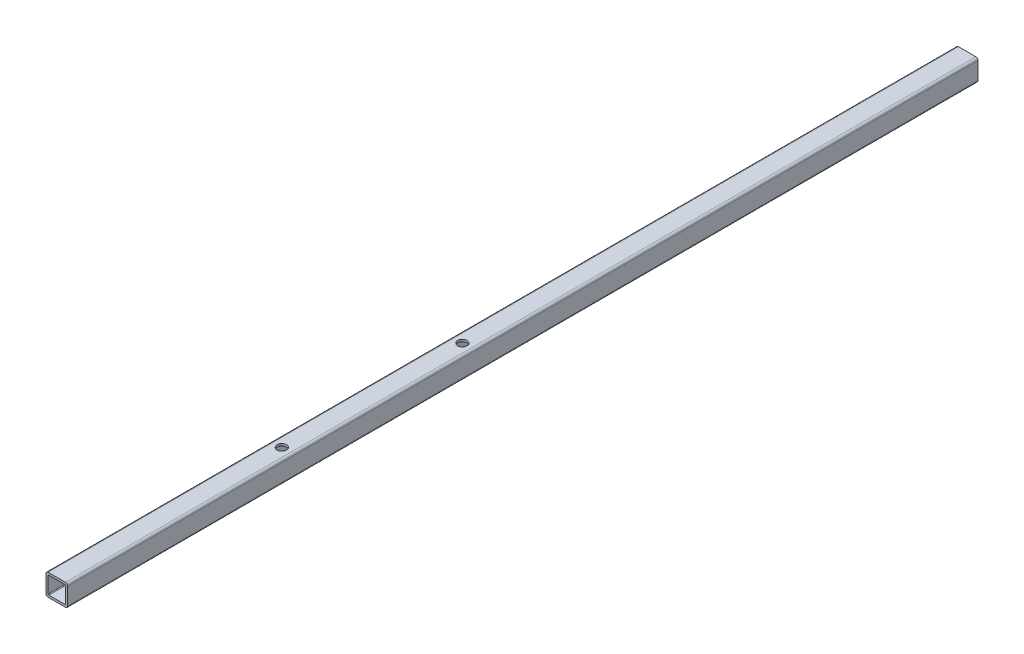
ISO-10303-21;
HEADER;
FILE_DESCRIPTION(('STEP AP214'),'2;1');
FILE_NAME('part.step','',(''),(''),'','','');
FILE_SCHEMA(('AUTOMOTIVE_DESIGN { 1 0 10303 214 1 1 1 1 }'));
ENDSEC;
DATA;
#1=APPLICATION_CONTEXT('core data for automotive mechanical design processes');
#2=APPLICATION_PROTOCOL_DEFINITION('international standard','automotive_design',2000,#1);
#3=PRODUCT_CONTEXT('',#1,'mechanical');
#4=PRODUCT('Part','Part','',(#3));
#5=PRODUCT_RELATED_PRODUCT_CATEGORY('part','',(#4));
#6=PRODUCT_DEFINITION_FORMATION('','',#4);
#7=PRODUCT_DEFINITION_CONTEXT('part definition',#1,'design');
#8=PRODUCT_DEFINITION('design','',#6,#7);
#9=PRODUCT_DEFINITION_SHAPE('','',#8);
#10=(LENGTH_UNIT() NAMED_UNIT(*) SI_UNIT(.MILLI.,.METRE.));
#11=(NAMED_UNIT(*) PLANE_ANGLE_UNIT() SI_UNIT($,.RADIAN.));
#12=(NAMED_UNIT(*) SI_UNIT($,.STERADIAN.) SOLID_ANGLE_UNIT());
#13=UNCERTAINTY_MEASURE_WITH_UNIT(LENGTH_MEASURE(1.E-05),#10,'distance_accuracy_value','');
#14=(GEOMETRIC_REPRESENTATION_CONTEXT(3) GLOBAL_UNCERTAINTY_ASSIGNED_CONTEXT((#13)) GLOBAL_UNIT_ASSIGNED_CONTEXT((#10,
#11,#12)) REPRESENTATION_CONTEXT('',''));
#15=CARTESIAN_POINT('',(0.,0.,0.));
#16=DIRECTION('',(0.,0.,1.));
#17=DIRECTION('',(1.,0.,0.));
#18=AXIS2_PLACEMENT_3D('',#15,#16,#17);
#19=CARTESIAN_POINT('',(-12.,-12.,1260.));
#20=DIRECTION('',(0.,0.,-1.));
#21=DIRECTION('',(-1.,0.,0.));
#22=AXIS2_PLACEMENT_3D('',#19,#20,#21);
#23=PLANE('',#22);
#24=CARTESIAN_POINT('',(-12.,-12.,1260.));
#25=DIRECTION('',(0.,0.,1.));
#26=DIRECTION('',(-1.,0.,0.));
#27=AXIS2_PLACEMENT_3D('',#24,#25,#26);
#28=CIRCLE('',#27,3.);
#29=CARTESIAN_POINT('',(-15.,-12.,1260.));
#30=VERTEX_POINT('',#29);
#31=CARTESIAN_POINT('',(-12.,-15.,1260.));
#32=VERTEX_POINT('',#31);
#33=EDGE_CURVE('E262',#30,#32,#28,.T.);
#34=ORIENTED_EDGE('',*,*,#33,.T.);
#35=DIRECTION('',(1.,0.,0.));
#36=VECTOR('',#35,1.);
#37=CARTESIAN_POINT('',(-12.,-15.,1260.));
#38=LINE('',#37,#36);
#39=CARTESIAN_POINT('',(12.,-15.,1260.));
#40=VERTEX_POINT('',#39);
#41=EDGE_CURVE('E266',#32,#40,#38,.T.);
#42=ORIENTED_EDGE('',*,*,#41,.T.);
#43=CARTESIAN_POINT('',(12.,-12.,1260.));
#44=DIRECTION('',(0.,0.,1.));
#45=DIRECTION('',(-1.,0.,0.));
#46=AXIS2_PLACEMENT_3D('',#43,#44,#45);
#47=CIRCLE('',#46,3.);
#48=CARTESIAN_POINT('',(15.,-12.,1260.));
#49=VERTEX_POINT('',#48);
#50=EDGE_CURVE('E270',#40,#49,#47,.T.);
#51=ORIENTED_EDGE('',*,*,#50,.T.);
#52=DIRECTION('',(0.,1.,0.));
#53=VECTOR('',#52,1.);
#54=CARTESIAN_POINT('',(15.,-12.,1260.));
#55=LINE('',#54,#53);
#56=CARTESIAN_POINT('',(15.,12.,1260.));
#57=VERTEX_POINT('',#56);
#58=EDGE_CURVE('E273',#49,#57,#55,.T.);
#59=ORIENTED_EDGE('',*,*,#58,.T.);
#60=CARTESIAN_POINT('',(12.,12.,1260.));
#61=DIRECTION('',(0.,0.,1.));
#62=DIRECTION('',(-1.,0.,0.));
#63=AXIS2_PLACEMENT_3D('',#60,#61,#62);
#64=CIRCLE('',#63,3.);
#65=CARTESIAN_POINT('',(12.,15.,1260.));
#66=VERTEX_POINT('',#65);
#67=EDGE_CURVE('E276',#57,#66,#64,.T.);
#68=ORIENTED_EDGE('',*,*,#67,.T.);
#69=DIRECTION('',(-1.,0.,0.));
#70=VECTOR('',#69,1.);
#71=CARTESIAN_POINT('',(-12.,15.,1260.));
#72=LINE('',#71,#70);
#73=CARTESIAN_POINT('',(-12.,15.,1260.));
#74=VERTEX_POINT('',#73);
#75=EDGE_CURVE('E279',#66,#74,#72,.T.);
#76=ORIENTED_EDGE('',*,*,#75,.T.);
#77=CARTESIAN_POINT('',(-12.,12.,1260.));
#78=DIRECTION('',(0.,0.,1.));
#79=DIRECTION('',(-1.,0.,0.));
#80=AXIS2_PLACEMENT_3D('',#77,#78,#79);
#81=CIRCLE('',#80,3.);
#82=CARTESIAN_POINT('',(-15.,12.,1260.));
#83=VERTEX_POINT('',#82);
#84=EDGE_CURVE('E282',#74,#83,#81,.T.);
#85=ORIENTED_EDGE('',*,*,#84,.T.);
#86=DIRECTION('',(0.,-1.,0.));
#87=VECTOR('',#86,1.);
#88=CARTESIAN_POINT('',(-15.,-12.,1260.));
#89=LINE('',#88,#87);
#90=EDGE_CURVE('E285',#83,#30,#89,.T.);
#91=ORIENTED_EDGE('',*,*,#90,.T.);
#92=EDGE_LOOP('',(#34,#42,#51,#59,#68,#76,#85,#91));
#93=FACE_BOUND('',#92,.T.);
#94=CARTESIAN_POINT('',(-11.,-11.,1260.));
#95=DIRECTION('',(0.,0.,1.));
#96=DIRECTION('',(1.,0.,0.));
#97=AXIS2_PLACEMENT_3D('',#94,#95,#96);
#98=CIRCLE('',#97,1.);
#99=CARTESIAN_POINT('',(-12.,-11.,1260.));
#100=VERTEX_POINT('',#99);
#101=CARTESIAN_POINT('',(-11.,-12.,1260.));
#102=VERTEX_POINT('',#101);
#103=EDGE_CURVE('E170',#100,#102,#98,.T.);
#104=ORIENTED_EDGE('',*,*,#103,.F.);
#105=DIRECTION('',(0.,-1.,0.));
#106=VECTOR('',#105,1.);
#107=CARTESIAN_POINT('',(-12.,-11.,1260.));
#108=LINE('',#107,#106);
#109=CARTESIAN_POINT('',(-12.,11.,1260.));
#110=VERTEX_POINT('',#109);
#111=EDGE_CURVE('E213',#110,#100,#108,.T.);
#112=ORIENTED_EDGE('',*,*,#111,.F.);
#113=CARTESIAN_POINT('',(-11.,11.,1260.));
#114=DIRECTION('',(0.,0.,1.));
#115=DIRECTION('',(1.,0.,0.));
#116=AXIS2_PLACEMENT_3D('',#113,#114,#115);
#117=CIRCLE('',#116,1.);
#118=CARTESIAN_POINT('',(-11.,12.,1260.));
#119=VERTEX_POINT('',#118);
#120=EDGE_CURVE('E210',#119,#110,#117,.T.);
#121=ORIENTED_EDGE('',*,*,#120,.F.);
#122=DIRECTION('',(-1.,0.,0.));
#123=VECTOR('',#122,1.);
#124=CARTESIAN_POINT('',(-11.,12.,1260.));
#125=LINE('',#124,#123);
#126=CARTESIAN_POINT('',(11.,12.,1260.));
#127=VERTEX_POINT('',#126);
#128=EDGE_CURVE('E207',#127,#119,#125,.T.);
#129=ORIENTED_EDGE('',*,*,#128,.F.);
#130=CARTESIAN_POINT('',(11.,11.,1260.));
#131=DIRECTION('',(0.,0.,1.));
#132=DIRECTION('',(1.,0.,0.));
#133=AXIS2_PLACEMENT_3D('',#130,#131,#132);
#134=CIRCLE('',#133,1.);
#135=CARTESIAN_POINT('',(12.,11.,1260.));
#136=VERTEX_POINT('',#135);
#137=EDGE_CURVE('E204',#136,#127,#134,.T.);
#138=ORIENTED_EDGE('',*,*,#137,.F.);
#139=DIRECTION('',(0.,1.,0.));
#140=VECTOR('',#139,1.);
#141=CARTESIAN_POINT('',(12.,-11.,1260.));
#142=LINE('',#141,#140);
#143=CARTESIAN_POINT('',(12.,-11.,1260.));
#144=VERTEX_POINT('',#143);
#145=EDGE_CURVE('E198',#144,#136,#142,.T.);
#146=ORIENTED_EDGE('',*,*,#145,.F.);
#147=CARTESIAN_POINT('',(11.,-11.,1260.));
#148=DIRECTION('',(0.,0.,1.));
#149=DIRECTION('',(1.,0.,0.));
#150=AXIS2_PLACEMENT_3D('',#147,#148,#149);
#151=CIRCLE('',#150,1.);
#152=CARTESIAN_POINT('',(11.,-12.,1260.));
#153=VERTEX_POINT('',#152);
#154=EDGE_CURVE('E193',#153,#144,#151,.T.);
#155=ORIENTED_EDGE('',*,*,#154,.F.);
#156=DIRECTION('',(1.,0.,0.));
#157=VECTOR('',#156,1.);
#158=CARTESIAN_POINT('',(-11.,-12.,1260.));
#159=LINE('',#158,#157);
#160=EDGE_CURVE('E179',#102,#153,#159,.T.);
#161=ORIENTED_EDGE('',*,*,#160,.F.);
#162=EDGE_LOOP('',(#104,#112,#121,#129,#138,#146,#155,#161));
#163=FACE_BOUND('',#162,.T.);
#164=ADVANCED_FACE('F54',(#93,#163),#23,.F.);
#165=CARTESIAN_POINT('',(-12.,-12.,0.));
#166=DIRECTION('',(0.,0.,-1.));
#167=DIRECTION('',(-1.,0.,0.));
#168=AXIS2_PLACEMENT_3D('',#165,#166,#167);
#169=PLANE('',#168);
#170=CARTESIAN_POINT('',(-12.,-12.,0.));
#171=DIRECTION('',(0.,0.,1.));
#172=DIRECTION('',(-1.,0.,0.));
#173=AXIS2_PLACEMENT_3D('',#170,#171,#172);
#174=CIRCLE('',#173,3.);
#175=CARTESIAN_POINT('',(-15.,-12.,0.));
#176=VERTEX_POINT('',#175);
#177=CARTESIAN_POINT('',(-12.,-15.,0.));
#178=VERTEX_POINT('',#177);
#179=EDGE_CURVE('E188',#176,#178,#174,.T.);
#180=ORIENTED_EDGE('',*,*,#179,.F.);
#181=DIRECTION('',(0.,-1.,0.));
#182=VECTOR('',#181,1.);
#183=CARTESIAN_POINT('',(-15.,-12.,0.));
#184=LINE('',#183,#182);
#185=CARTESIAN_POINT('',(-15.,12.,0.));
#186=VERTEX_POINT('',#185);
#187=EDGE_CURVE('E267',#186,#176,#184,.T.);
#188=ORIENTED_EDGE('',*,*,#187,.F.);
#189=CARTESIAN_POINT('',(-12.,12.,0.));
#190=DIRECTION('',(0.,0.,1.));
#191=DIRECTION('',(-1.,0.,0.));
#192=AXIS2_PLACEMENT_3D('',#189,#190,#191);
#193=CIRCLE('',#192,3.);
#194=CARTESIAN_POINT('',(-12.,15.,0.));
#195=VERTEX_POINT('',#194);
#196=EDGE_CURVE('E307',#195,#186,#193,.T.);
#197=ORIENTED_EDGE('',*,*,#196,.F.);
#198=DIRECTION('',(-1.,0.,0.));
#199=VECTOR('',#198,1.);
#200=CARTESIAN_POINT('',(-12.,15.,0.));
#201=LINE('',#200,#199);
#202=CARTESIAN_POINT('',(12.,15.,0.));
#203=VERTEX_POINT('',#202);
#204=EDGE_CURVE('E304',#203,#195,#201,.T.);
#205=ORIENTED_EDGE('',*,*,#204,.F.);
#206=CARTESIAN_POINT('',(12.,12.,0.));
#207=DIRECTION('',(0.,0.,1.));
#208=DIRECTION('',(-1.,0.,0.));
#209=AXIS2_PLACEMENT_3D('',#206,#207,#208);
#210=CIRCLE('',#209,3.);
#211=CARTESIAN_POINT('',(15.,12.,0.));
#212=VERTEX_POINT('',#211);
#213=EDGE_CURVE('E301',#212,#203,#210,.T.);
#214=ORIENTED_EDGE('',*,*,#213,.F.);
#215=DIRECTION('',(0.,1.,0.));
#216=VECTOR('',#215,1.);
#217=CARTESIAN_POINT('',(15.,-12.,0.));
#218=LINE('',#217,#216);
#219=CARTESIAN_POINT('',(15.,-12.,0.));
#220=VERTEX_POINT('',#219);
#221=EDGE_CURVE('E298',#220,#212,#218,.T.);
#222=ORIENTED_EDGE('',*,*,#221,.F.);
#223=CARTESIAN_POINT('',(12.,-12.,0.));
#224=DIRECTION('',(0.,0.,1.));
#225=DIRECTION('',(-1.,0.,0.));
#226=AXIS2_PLACEMENT_3D('',#223,#224,#225);
#227=CIRCLE('',#226,3.);
#228=CARTESIAN_POINT('',(12.,-15.,0.));
#229=VERTEX_POINT('',#228);
#230=EDGE_CURVE('E295',#229,#220,#227,.T.);
#231=ORIENTED_EDGE('',*,*,#230,.F.);
#232=DIRECTION('',(1.,0.,0.));
#233=VECTOR('',#232,1.);
#234=CARTESIAN_POINT('',(-12.,-15.,0.));
#235=LINE('',#234,#233);
#236=EDGE_CURVE('E292',#178,#229,#235,.T.);
#237=ORIENTED_EDGE('',*,*,#236,.F.);
#238=EDGE_LOOP('',(#180,#188,#197,#205,#214,#222,#231,#237));
#239=FACE_BOUND('',#238,.T.);
#240=DIRECTION('',(0.,-1.,0.));
#241=VECTOR('',#240,1.);
#242=CARTESIAN_POINT('',(-12.,-11.,0.));
#243=LINE('',#242,#241);
#244=CARTESIAN_POINT('',(-12.,11.,0.));
#245=VERTEX_POINT('',#244);
#246=CARTESIAN_POINT('',(-12.,-11.,0.));
#247=VERTEX_POINT('',#246);
#248=EDGE_CURVE('E180',#245,#247,#243,.T.);
#249=ORIENTED_EDGE('',*,*,#248,.T.);
#250=CARTESIAN_POINT('',(-11.,-11.,0.));
#251=DIRECTION('',(0.,0.,1.));
#252=DIRECTION('',(1.,0.,0.));
#253=AXIS2_PLACEMENT_3D('',#250,#251,#252);
#254=CIRCLE('',#253,1.);
#255=CARTESIAN_POINT('',(-11.,-12.,0.));
#256=VERTEX_POINT('',#255);
#257=EDGE_CURVE('E80',#247,#256,#254,.T.);
#258=ORIENTED_EDGE('',*,*,#257,.T.);
#259=DIRECTION('',(1.,0.,0.));
#260=VECTOR('',#259,1.);
#261=CARTESIAN_POINT('',(-11.,-12.,0.));
#262=LINE('',#261,#260);
#263=CARTESIAN_POINT('',(11.,-12.,0.));
#264=VERTEX_POINT('',#263);
#265=EDGE_CURVE('E186',#256,#264,#262,.T.);
#266=ORIENTED_EDGE('',*,*,#265,.T.);
#267=CARTESIAN_POINT('',(11.,-11.,0.));
#268=DIRECTION('',(0.,0.,1.));
#269=DIRECTION('',(1.,0.,0.));
#270=AXIS2_PLACEMENT_3D('',#267,#268,#269);
#271=CIRCLE('',#270,1.);
#272=CARTESIAN_POINT('',(12.,-11.,0.));
#273=VERTEX_POINT('',#272);
#274=EDGE_CURVE('E221',#264,#273,#271,.T.);
#275=ORIENTED_EDGE('',*,*,#274,.T.);
#276=DIRECTION('',(0.,1.,0.));
#277=VECTOR('',#276,1.);
#278=CARTESIAN_POINT('',(12.,-11.,0.));
#279=LINE('',#278,#277);
#280=CARTESIAN_POINT('',(12.,11.,0.));
#281=VERTEX_POINT('',#280);
#282=EDGE_CURVE('E225',#273,#281,#279,.T.);
#283=ORIENTED_EDGE('',*,*,#282,.T.);
#284=CARTESIAN_POINT('',(11.,11.,0.));
#285=DIRECTION('',(0.,0.,1.));
#286=DIRECTION('',(1.,0.,0.));
#287=AXIS2_PLACEMENT_3D('',#284,#285,#286);
#288=CIRCLE('',#287,1.);
#289=CARTESIAN_POINT('',(11.,12.,0.));
#290=VERTEX_POINT('',#289);
#291=EDGE_CURVE('E229',#281,#290,#288,.T.);
#292=ORIENTED_EDGE('',*,*,#291,.T.);
#293=DIRECTION('',(-1.,0.,0.));
#294=VECTOR('',#293,1.);
#295=CARTESIAN_POINT('',(-11.,12.,0.));
#296=LINE('',#295,#294);
#297=CARTESIAN_POINT('',(-11.,12.,0.));
#298=VERTEX_POINT('',#297);
#299=EDGE_CURVE('E233',#290,#298,#296,.T.);
#300=ORIENTED_EDGE('',*,*,#299,.T.);
#301=CARTESIAN_POINT('',(-11.,11.,0.));
#302=DIRECTION('',(0.,0.,1.));
#303=DIRECTION('',(1.,0.,0.));
#304=AXIS2_PLACEMENT_3D('',#301,#302,#303);
#305=CIRCLE('',#304,1.);
#306=EDGE_CURVE('E237',#298,#245,#305,.T.);
#307=ORIENTED_EDGE('',*,*,#306,.T.);
#308=EDGE_LOOP('',(#249,#258,#266,#275,#283,#292,#300,#307));
#309=FACE_BOUND('',#308,.T.);
#310=ADVANCED_FACE('F393',(#239,#309),#169,.T.);
#311=CARTESIAN_POINT('',(-12.,-12.,1260.));
#312=DIRECTION('',(0.,0.,-1.));
#313=DIRECTION('',(-1.,0.,0.));
#314=AXIS2_PLACEMENT_3D('',#311,#312,#313);
#315=CYLINDRICAL_SURFACE('',#314,3.);
#316=ORIENTED_EDGE('',*,*,#179,.T.);
#317=DIRECTION('',(0.,0.,-1.));
#318=VECTOR('',#317,1.);
#319=CARTESIAN_POINT('',(-12.,-15.,1260.));
#320=LINE('',#319,#318);
#321=EDGE_CURVE('E13',#32,#178,#320,.T.);
#322=ORIENTED_EDGE('',*,*,#321,.F.);
#323=ORIENTED_EDGE('',*,*,#33,.F.);
#324=DIRECTION('',(0.,0.,-1.));
#325=VECTOR('',#324,1.);
#326=CARTESIAN_POINT('',(-15.,-12.,1260.));
#327=LINE('',#326,#325);
#328=EDGE_CURVE('E288',#30,#176,#327,.T.);
#329=ORIENTED_EDGE('',*,*,#328,.T.);
#330=EDGE_LOOP('',(#316,#322,#323,#329));
#331=FACE_BOUND('',#330,.T.);
#332=ADVANCED_FACE('F56',(#331),#315,.T.);
#333=CARTESIAN_POINT('',(-12.,-15.,1260.));
#334=DIRECTION('',(0.,1.,0.));
#335=DIRECTION('',(0.,0.,1.));
#336=AXIS2_PLACEMENT_3D('',#333,#334,#335);
#337=PLANE('',#336);
#338=CARTESIAN_POINT('',(0.,-15.,948.6));
#339=DIRECTION('',(0.,1.,0.));
#340=DIRECTION('',(0.,0.,1.));
#341=AXIS2_PLACEMENT_3D('',#338,#339,#340);
#342=CIRCLE('',#341,6.5);
#343=CARTESIAN_POINT('',(0.,-15.,955.1));
#344=VERTEX_POINT('',#343);
#345=EDGE_CURVE('E341',#344,#344,#342,.F.);
#346=ORIENTED_EDGE('',*,*,#345,.F.);
#347=EDGE_LOOP('',(#346));
#348=FACE_BOUND('',#347,.T.);
#349=CARTESIAN_POINT('',(0.,-15.,698.6));
#350=DIRECTION('',(0.,1.,0.));
#351=DIRECTION('',(0.,0.,1.));
#352=AXIS2_PLACEMENT_3D('',#349,#350,#351);
#353=CIRCLE('',#352,6.5);
#354=CARTESIAN_POINT('',(0.,-15.,705.1));
#355=VERTEX_POINT('',#354);
#356=EDGE_CURVE('E360',#355,#355,#353,.F.);
#357=ORIENTED_EDGE('',*,*,#356,.F.);
#358=EDGE_LOOP('',(#357));
#359=FACE_BOUND('',#358,.T.);
#360=ORIENTED_EDGE('',*,*,#236,.T.);
#361=DIRECTION('',(0.,0.,-1.));
#362=VECTOR('',#361,1.);
#363=CARTESIAN_POINT('',(12.,-15.,1260.));
#364=LINE('',#363,#362);
#365=EDGE_CURVE('E64',#40,#229,#364,.T.);
#366=ORIENTED_EDGE('',*,*,#365,.F.);
#367=ORIENTED_EDGE('',*,*,#41,.F.);
#368=ORIENTED_EDGE('',*,*,#321,.T.);
#369=EDGE_LOOP('',(#360,#366,#367,#368));
#370=FACE_BOUND('',#369,.T.);
#371=ADVANCED_FACE('F444',(#348,#359,#370),#337,.F.);
#372=CARTESIAN_POINT('',(12.,-12.,1260.));
#373=DIRECTION('',(0.,0.,-1.));
#374=DIRECTION('',(-1.,0.,0.));
#375=AXIS2_PLACEMENT_3D('',#372,#373,#374);
#376=CYLINDRICAL_SURFACE('',#375,3.);
#377=ORIENTED_EDGE('',*,*,#230,.T.);
#378=DIRECTION('',(0.,0.,-1.));
#379=VECTOR('',#378,1.);
#380=CARTESIAN_POINT('',(15.,-12.,1260.));
#381=LINE('',#380,#379);
#382=EDGE_CURVE('E331',#49,#220,#381,.T.);
#383=ORIENTED_EDGE('',*,*,#382,.F.);
#384=ORIENTED_EDGE('',*,*,#50,.F.);
#385=ORIENTED_EDGE('',*,*,#365,.T.);
#386=EDGE_LOOP('',(#377,#383,#384,#385));
#387=FACE_BOUND('',#386,.T.);
#388=ADVANCED_FACE('F441',(#387),#376,.T.);
#389=CARTESIAN_POINT('',(15.,-12.,1260.));
#390=DIRECTION('',(-1.,0.,0.));
#391=DIRECTION('',(0.,0.,1.));
#392=AXIS2_PLACEMENT_3D('',#389,#390,#391);
#393=PLANE('',#392);
#394=ORIENTED_EDGE('',*,*,#221,.T.);
#395=DIRECTION('',(0.,0.,-1.));
#396=VECTOR('',#395,1.);
#397=CARTESIAN_POINT('',(15.,12.,1260.));
#398=LINE('',#397,#396);
#399=EDGE_CURVE('E327',#57,#212,#398,.T.);
#400=ORIENTED_EDGE('',*,*,#399,.F.);
#401=ORIENTED_EDGE('',*,*,#58,.F.);
#402=ORIENTED_EDGE('',*,*,#382,.T.);
#403=EDGE_LOOP('',(#394,#400,#401,#402));
#404=FACE_BOUND('',#403,.T.);
#405=ADVANCED_FACE('F437',(#404),#393,.F.);
#406=CARTESIAN_POINT('',(12.,12.,1260.));
#407=DIRECTION('',(0.,0.,-1.));
#408=DIRECTION('',(-1.,0.,0.));
#409=AXIS2_PLACEMENT_3D('',#406,#407,#408);
#410=CYLINDRICAL_SURFACE('',#409,3.);
#411=ORIENTED_EDGE('',*,*,#213,.T.);
#412=DIRECTION('',(0.,0.,-1.));
#413=VECTOR('',#412,1.);
#414=CARTESIAN_POINT('',(12.,15.,1260.));
#415=LINE('',#414,#413);
#416=EDGE_CURVE('E323',#66,#203,#415,.T.);
#417=ORIENTED_EDGE('',*,*,#416,.F.);
#418=ORIENTED_EDGE('',*,*,#67,.F.);
#419=ORIENTED_EDGE('',*,*,#399,.T.);
#420=EDGE_LOOP('',(#411,#417,#418,#419));
#421=FACE_BOUND('',#420,.T.);
#422=ADVANCED_FACE('F433',(#421),#410,.T.);
#423=CARTESIAN_POINT('',(-12.,15.,1260.));
#424=DIRECTION('',(0.,-1.,0.));
#425=DIRECTION('',(0.,0.,-1.));
#426=AXIS2_PLACEMENT_3D('',#423,#424,#425);
#427=PLANE('',#426);
#428=CARTESIAN_POINT('',(0.,15.,948.6));
#429=DIRECTION('',(0.,1.,0.));
#430=DIRECTION('',(0.,0.,1.));
#431=AXIS2_PLACEMENT_3D('',#428,#429,#430);
#432=CIRCLE('',#431,6.5);
#433=CARTESIAN_POINT('',(0.,15.,955.1));
#434=VERTEX_POINT('',#433);
#435=EDGE_CURVE('E350',#434,#434,#432,.T.);
#436=ORIENTED_EDGE('',*,*,#435,.F.);
#437=EDGE_LOOP('',(#436));
#438=FACE_BOUND('',#437,.T.);
#439=CARTESIAN_POINT('',(0.,15.,698.6));
#440=DIRECTION('',(0.,1.,0.));
#441=DIRECTION('',(0.,0.,1.));
#442=AXIS2_PLACEMENT_3D('',#439,#440,#441);
#443=CIRCLE('',#442,6.5);
#444=CARTESIAN_POINT('',(0.,15.,705.1));
#445=VERTEX_POINT('',#444);
#446=EDGE_CURVE('E357',#445,#445,#443,.T.);
#447=ORIENTED_EDGE('',*,*,#446,.F.);
#448=EDGE_LOOP('',(#447));
#449=FACE_BOUND('',#448,.T.);
#450=ORIENTED_EDGE('',*,*,#204,.T.);
#451=DIRECTION('',(0.,0.,-1.));
#452=VECTOR('',#451,1.);
#453=CARTESIAN_POINT('',(-12.,15.,1260.));
#454=LINE('',#453,#452);
#455=EDGE_CURVE('E319',#74,#195,#454,.T.);
#456=ORIENTED_EDGE('',*,*,#455,.F.);
#457=ORIENTED_EDGE('',*,*,#75,.F.);
#458=ORIENTED_EDGE('',*,*,#416,.T.);
#459=EDGE_LOOP('',(#450,#456,#457,#458));
#460=FACE_BOUND('',#459,.T.);
#461=ADVANCED_FACE('F429',(#438,#449,#460),#427,.F.);
#462=CARTESIAN_POINT('',(-12.,12.,1260.));
#463=DIRECTION('',(0.,0.,-1.));
#464=DIRECTION('',(-1.,0.,0.));
#465=AXIS2_PLACEMENT_3D('',#462,#463,#464);
#466=CYLINDRICAL_SURFACE('',#465,3.);
#467=ORIENTED_EDGE('',*,*,#196,.T.);
#468=DIRECTION('',(0.,0.,-1.));
#469=VECTOR('',#468,1.);
#470=CARTESIAN_POINT('',(-15.,12.,1260.));
#471=LINE('',#470,#469);
#472=EDGE_CURVE('E315',#83,#186,#471,.T.);
#473=ORIENTED_EDGE('',*,*,#472,.F.);
#474=ORIENTED_EDGE('',*,*,#84,.F.);
#475=ORIENTED_EDGE('',*,*,#455,.T.);
#476=EDGE_LOOP('',(#467,#473,#474,#475));
#477=FACE_BOUND('',#476,.T.);
#478=ADVANCED_FACE('F425',(#477),#466,.T.);
#479=CARTESIAN_POINT('',(-15.,-12.,1260.));
#480=DIRECTION('',(1.,0.,0.));
#481=DIRECTION('',(0.,0.,-1.));
#482=AXIS2_PLACEMENT_3D('',#479,#480,#481);
#483=PLANE('',#482);
#484=ORIENTED_EDGE('',*,*,#187,.T.);
#485=ORIENTED_EDGE('',*,*,#328,.F.);
#486=ORIENTED_EDGE('',*,*,#90,.F.);
#487=ORIENTED_EDGE('',*,*,#472,.T.);
#488=EDGE_LOOP('',(#484,#485,#486,#487));
#489=FACE_BOUND('',#488,.T.);
#490=ADVANCED_FACE('F422',(#489),#483,.F.);
#491=CARTESIAN_POINT('',(-11.,-11.,1260.));
#492=DIRECTION('',(0.,0.,-1.));
#493=DIRECTION('',(-1.,0.,0.));
#494=AXIS2_PLACEMENT_3D('',#491,#492,#493);
#495=CYLINDRICAL_SURFACE('',#494,1.);
#496=ORIENTED_EDGE('',*,*,#257,.F.);
#497=DIRECTION('',(0.,0.,-1.));
#498=VECTOR('',#497,1.);
#499=CARTESIAN_POINT('',(-12.,-11.,1260.));
#500=LINE('',#499,#498);
#501=EDGE_CURVE('E174',#100,#247,#500,.T.);
#502=ORIENTED_EDGE('',*,*,#501,.F.);
#503=ORIENTED_EDGE('',*,*,#103,.T.);
#504=DIRECTION('',(0.,0.,-1.));
#505=VECTOR('',#504,1.);
#506=CARTESIAN_POINT('',(-11.,-12.,1260.));
#507=LINE('',#506,#505);
#508=EDGE_CURVE('E173',#102,#256,#507,.T.);
#509=ORIENTED_EDGE('',*,*,#508,.T.);
#510=EDGE_LOOP('',(#496,#502,#503,#509));
#511=FACE_BOUND('',#510,.T.);
#512=ADVANCED_FACE('F172',(#511),#495,.F.);
#513=CARTESIAN_POINT('',(-11.,-12.,1260.));
#514=DIRECTION('',(0.,1.,0.));
#515=DIRECTION('',(0.,0.,1.));
#516=AXIS2_PLACEMENT_3D('',#513,#514,#515);
#517=PLANE('',#516);
#518=CARTESIAN_POINT('',(0.,-12.,948.6));
#519=DIRECTION('',(0.,1.,0.));
#520=DIRECTION('',(0.,0.,1.));
#521=AXIS2_PLACEMENT_3D('',#518,#519,#520);
#522=CIRCLE('',#521,6.5);
#523=CARTESIAN_POINT('',(0.,-12.,955.1));
#524=VERTEX_POINT('',#523);
#525=EDGE_CURVE('E218',#524,#524,#522,.T.);
#526=ORIENTED_EDGE('',*,*,#525,.F.);
#527=EDGE_LOOP('',(#526));
#528=FACE_BOUND('',#527,.T.);
#529=CARTESIAN_POINT('',(0.,-12.,698.6));
#530=DIRECTION('',(0.,1.,0.));
#531=DIRECTION('',(0.,0.,1.));
#532=AXIS2_PLACEMENT_3D('',#529,#530,#531);
#533=CIRCLE('',#532,6.5);
#534=CARTESIAN_POINT('',(0.,-12.,705.1));
#535=VERTEX_POINT('',#534);
#536=EDGE_CURVE('E340',#535,#535,#533,.T.);
#537=ORIENTED_EDGE('',*,*,#536,.F.);
#538=EDGE_LOOP('',(#537));
#539=FACE_BOUND('',#538,.T.);
#540=ORIENTED_EDGE('',*,*,#265,.F.);
#541=ORIENTED_EDGE('',*,*,#508,.F.);
#542=ORIENTED_EDGE('',*,*,#160,.T.);
#543=DIRECTION('',(0.,0.,-1.));
#544=VECTOR('',#543,1.);
#545=CARTESIAN_POINT('',(11.,-12.,1260.));
#546=LINE('',#545,#544);
#547=EDGE_CURVE('E189',#153,#264,#546,.T.);
#548=ORIENTED_EDGE('',*,*,#547,.T.);
#549=EDGE_LOOP('',(#540,#541,#542,#548));
#550=FACE_BOUND('',#549,.T.);
#551=ADVANCED_FACE('F183',(#528,#539,#550),#517,.T.);
#552=CARTESIAN_POINT('',(11.,-11.,1260.));
#553=DIRECTION('',(0.,0.,-1.));
#554=DIRECTION('',(-1.,0.,0.));
#555=AXIS2_PLACEMENT_3D('',#552,#553,#554);
#556=CYLINDRICAL_SURFACE('',#555,1.);
#557=ORIENTED_EDGE('',*,*,#274,.F.);
#558=ORIENTED_EDGE('',*,*,#547,.F.);
#559=ORIENTED_EDGE('',*,*,#154,.T.);
#560=DIRECTION('',(0.,0.,-1.));
#561=VECTOR('',#560,1.);
#562=CARTESIAN_POINT('',(12.,-11.,1260.));
#563=LINE('',#562,#561);
#564=EDGE_CURVE('E257',#144,#273,#563,.T.);
#565=ORIENTED_EDGE('',*,*,#564,.T.);
#566=EDGE_LOOP('',(#557,#558,#559,#565));
#567=FACE_BOUND('',#566,.T.);
#568=ADVANCED_FACE('F490',(#567),#556,.F.);
#569=CARTESIAN_POINT('',(12.,-11.,1260.));
#570=DIRECTION('',(-1.,0.,0.));
#571=DIRECTION('',(0.,0.,1.));
#572=AXIS2_PLACEMENT_3D('',#569,#570,#571);
#573=PLANE('',#572);
#574=ORIENTED_EDGE('',*,*,#282,.F.);
#575=ORIENTED_EDGE('',*,*,#564,.F.);
#576=ORIENTED_EDGE('',*,*,#145,.T.);
#577=DIRECTION('',(0.,0.,-1.));
#578=VECTOR('',#577,1.);
#579=CARTESIAN_POINT('',(12.,11.,1260.));
#580=LINE('',#579,#578);
#581=EDGE_CURVE('E254',#136,#281,#580,.T.);
#582=ORIENTED_EDGE('',*,*,#581,.T.);
#583=EDGE_LOOP('',(#574,#575,#576,#582));
#584=FACE_BOUND('',#583,.T.);
#585=ADVANCED_FACE('F496',(#584),#573,.T.);
#586=CARTESIAN_POINT('',(11.,11.,1260.));
#587=DIRECTION('',(0.,0.,-1.));
#588=DIRECTION('',(-1.,0.,0.));
#589=AXIS2_PLACEMENT_3D('',#586,#587,#588);
#590=CYLINDRICAL_SURFACE('',#589,1.);
#591=ORIENTED_EDGE('',*,*,#291,.F.);
#592=ORIENTED_EDGE('',*,*,#581,.F.);
#593=ORIENTED_EDGE('',*,*,#137,.T.);
#594=DIRECTION('',(0.,0.,-1.));
#595=VECTOR('',#594,1.);
#596=CARTESIAN_POINT('',(11.,12.,1260.));
#597=LINE('',#596,#595);
#598=EDGE_CURVE('E251',#127,#290,#597,.T.);
#599=ORIENTED_EDGE('',*,*,#598,.T.);
#600=EDGE_LOOP('',(#591,#592,#593,#599));
#601=FACE_BOUND('',#600,.T.);
#602=ADVANCED_FACE('F383',(#601),#590,.F.);
#603=CARTESIAN_POINT('',(-11.,12.,1260.));
#604=DIRECTION('',(0.,-1.,0.));
#605=DIRECTION('',(0.,0.,-1.));
#606=AXIS2_PLACEMENT_3D('',#603,#604,#605);
#607=PLANE('',#606);
#608=CARTESIAN_POINT('',(0.,12.,948.6));
#609=DIRECTION('',(0.,-1.,0.));
#610=DIRECTION('',(0.,0.,-1.));
#611=AXIS2_PLACEMENT_3D('',#608,#609,#610);
#612=CIRCLE('',#611,6.5);
#613=CARTESIAN_POINT('',(0.,12.,942.1));
#614=VERTEX_POINT('',#613);
#615=EDGE_CURVE('E58',#614,#614,#612,.T.);
#616=ORIENTED_EDGE('',*,*,#615,.F.);
#617=EDGE_LOOP('',(#616));
#618=FACE_BOUND('',#617,.T.);
#619=CARTESIAN_POINT('',(0.,12.,698.6));
#620=DIRECTION('',(0.,-1.,0.));
#621=DIRECTION('',(0.,0.,-1.));
#622=AXIS2_PLACEMENT_3D('',#619,#620,#621);
#623=CIRCLE('',#622,6.5);
#624=CARTESIAN_POINT('',(0.,12.,692.1));
#625=VERTEX_POINT('',#624);
#626=EDGE_CURVE('E337',#625,#625,#623,.T.);
#627=ORIENTED_EDGE('',*,*,#626,.F.);
#628=EDGE_LOOP('',(#627));
#629=FACE_BOUND('',#628,.T.);
#630=ORIENTED_EDGE('',*,*,#299,.F.);
#631=ORIENTED_EDGE('',*,*,#598,.F.);
#632=ORIENTED_EDGE('',*,*,#128,.T.);
#633=DIRECTION('',(0.,0.,-1.));
#634=VECTOR('',#633,1.);
#635=CARTESIAN_POINT('',(-11.,12.,1260.));
#636=LINE('',#635,#634);
#637=EDGE_CURVE('E248',#119,#298,#636,.T.);
#638=ORIENTED_EDGE('',*,*,#637,.T.);
#639=EDGE_LOOP('',(#630,#631,#632,#638));
#640=FACE_BOUND('',#639,.T.);
#641=ADVANCED_FACE('F379',(#618,#629,#640),#607,.T.);
#642=CARTESIAN_POINT('',(-11.,11.,1260.));
#643=DIRECTION('',(0.,0.,-1.));
#644=DIRECTION('',(-1.,0.,0.));
#645=AXIS2_PLACEMENT_3D('',#642,#643,#644);
#646=CYLINDRICAL_SURFACE('',#645,1.);
#647=ORIENTED_EDGE('',*,*,#306,.F.);
#648=ORIENTED_EDGE('',*,*,#637,.F.);
#649=ORIENTED_EDGE('',*,*,#120,.T.);
#650=DIRECTION('',(0.,0.,-1.));
#651=VECTOR('',#650,1.);
#652=CARTESIAN_POINT('',(-12.,11.,1260.));
#653=LINE('',#652,#651);
#654=EDGE_CURVE('E72',#110,#245,#653,.T.);
#655=ORIENTED_EDGE('',*,*,#654,.T.);
#656=EDGE_LOOP('',(#647,#648,#649,#655));
#657=FACE_BOUND('',#656,.T.);
#658=ADVANCED_FACE('F382',(#657),#646,.F.);
#659=CARTESIAN_POINT('',(-12.,-11.,1260.));
#660=DIRECTION('',(1.,0.,0.));
#661=DIRECTION('',(0.,0.,-1.));
#662=AXIS2_PLACEMENT_3D('',#659,#660,#661);
#663=PLANE('',#662);
#664=ORIENTED_EDGE('',*,*,#248,.F.);
#665=ORIENTED_EDGE('',*,*,#654,.F.);
#666=ORIENTED_EDGE('',*,*,#111,.T.);
#667=ORIENTED_EDGE('',*,*,#501,.T.);
#668=EDGE_LOOP('',(#664,#665,#666,#667));
#669=FACE_BOUND('',#668,.T.);
#670=ADVANCED_FACE('F400',(#669),#663,.T.);
#671=CARTESIAN_POINT('',(0.,-33.3847763108502,698.6));
#672=DIRECTION('',(0.,1.,0.));
#673=DIRECTION('',(0.,0.,1.));
#674=AXIS2_PLACEMENT_3D('',#671,#672,#673);
#675=CYLINDRICAL_SURFACE('',#674,6.5);
#676=ORIENTED_EDGE('',*,*,#626,.T.);
#677=EDGE_LOOP('',(#676));
#678=FACE_BOUND('',#677,.T.);
#679=ORIENTED_EDGE('',*,*,#446,.T.);
#680=EDGE_LOOP('',(#679));
#681=FACE_BOUND('',#680,.T.);
#682=ADVANCED_FACE('F402',(#678,#681),#675,.F.);
#683=CARTESIAN_POINT('',(0.,-33.3847763108502,948.6));
#684=DIRECTION('',(0.,1.,0.));
#685=DIRECTION('',(0.,0.,1.));
#686=AXIS2_PLACEMENT_3D('',#683,#684,#685);
#687=CYLINDRICAL_SURFACE('',#686,6.5);
#688=ORIENTED_EDGE('',*,*,#615,.T.);
#689=EDGE_LOOP('',(#688));
#690=FACE_BOUND('',#689,.T.);
#691=ORIENTED_EDGE('',*,*,#435,.T.);
#692=EDGE_LOOP('',(#691));
#693=FACE_BOUND('',#692,.T.);
#694=ADVANCED_FACE('F376',(#690,#693),#687,.F.);
#695=ORIENTED_EDGE('',*,*,#536,.T.);
#696=EDGE_LOOP('',(#695));
#697=FACE_BOUND('',#696,.T.);
#698=ORIENTED_EDGE('',*,*,#356,.T.);
#699=EDGE_LOOP('',(#698));
#700=FACE_BOUND('',#699,.T.);
#701=ADVANCED_FACE('F409',(#697,#700),#675,.F.);
#702=ORIENTED_EDGE('',*,*,#525,.T.);
#703=EDGE_LOOP('',(#702));
#704=FACE_BOUND('',#703,.T.);
#705=ORIENTED_EDGE('',*,*,#345,.T.);
#706=EDGE_LOOP('',(#705));
#707=FACE_BOUND('',#706,.T.);
#708=ADVANCED_FACE('F480',(#704,#707),#687,.F.);
#709=CLOSED_SHELL('',(#164,#310,#332,#371,#388,#405,#422,#461,#478,#490,#512,#551,#568,#585,
#602,#641,#658,#670,#682,#694,#701,#708));
#710=MANIFOLD_SOLID_BREP('B2',#709);
#711=ADVANCED_BREP_SHAPE_REPRESENTATION('',(#18,#710),#14);
#712=SHAPE_DEFINITION_REPRESENTATION(#9,#711);
ENDSEC;
END-ISO-10303-21;
